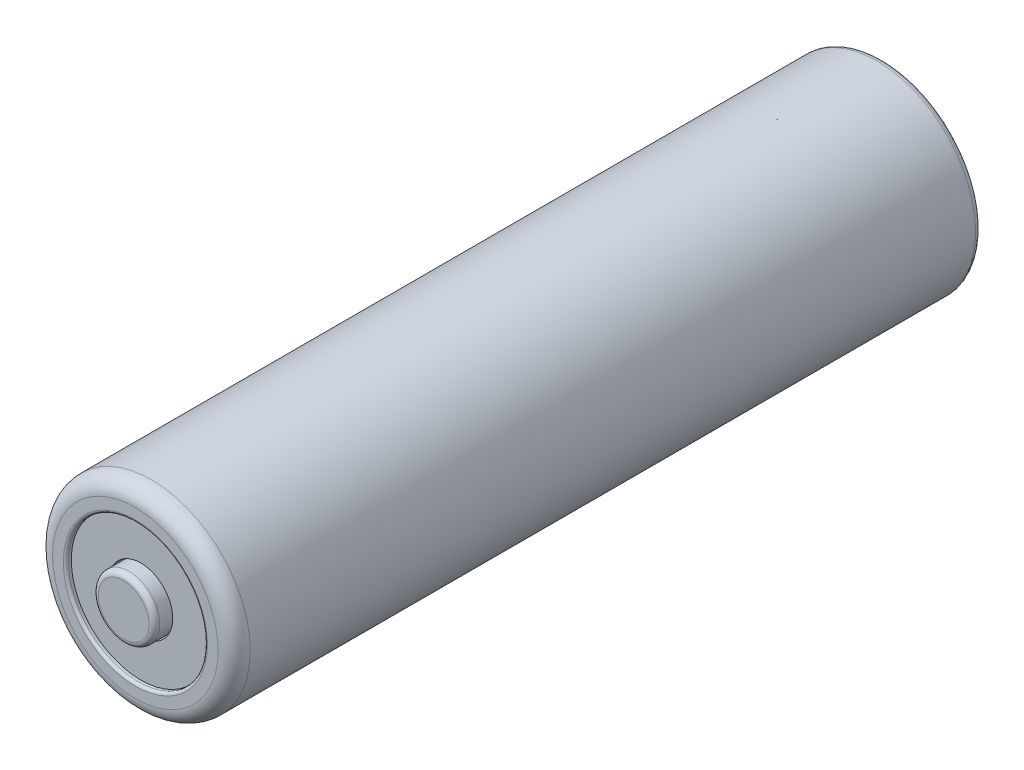
ISO-10303-21;
HEADER;
FILE_DESCRIPTION(('STEP AP214'),'2;1');
FILE_NAME('part.step','',(''),(''),'','','');
FILE_SCHEMA(('AUTOMOTIVE_DESIGN { 1 0 10303 214 1 1 1 1 }'));
ENDSEC;
DATA;
#1=APPLICATION_CONTEXT('core data for automotive mechanical design processes');
#2=APPLICATION_PROTOCOL_DEFINITION('international standard','automotive_design',2000,#1);
#3=PRODUCT_CONTEXT('',#1,'mechanical');
#4=PRODUCT('Part','Part','',(#3));
#5=PRODUCT_RELATED_PRODUCT_CATEGORY('part','',(#4));
#6=PRODUCT_DEFINITION_FORMATION('','',#4);
#7=PRODUCT_DEFINITION_CONTEXT('part definition',#1,'design');
#8=PRODUCT_DEFINITION('design','',#6,#7);
#9=PRODUCT_DEFINITION_SHAPE('','',#8);
#10=(LENGTH_UNIT() NAMED_UNIT(*) SI_UNIT(.MILLI.,.METRE.));
#11=(NAMED_UNIT(*) PLANE_ANGLE_UNIT() SI_UNIT($,.RADIAN.));
#12=(NAMED_UNIT(*) SI_UNIT($,.STERADIAN.) SOLID_ANGLE_UNIT());
#13=UNCERTAINTY_MEASURE_WITH_UNIT(LENGTH_MEASURE(1.E-05),#10,'distance_accuracy_value','');
#14=(GEOMETRIC_REPRESENTATION_CONTEXT(3) GLOBAL_UNCERTAINTY_ASSIGNED_CONTEXT((#13)) GLOBAL_UNIT_ASSIGNED_CONTEXT((#10,
#11,#12)) REPRESENTATION_CONTEXT('',''));
#15=CARTESIAN_POINT('',(0.,0.,0.));
#16=DIRECTION('',(0.,0.,1.));
#17=DIRECTION('',(1.,0.,0.));
#18=AXIS2_PLACEMENT_3D('',#15,#16,#17);
#19=CARTESIAN_POINT('',(0.,0.,0.250000000000004));
#20=DIRECTION('',(0.,0.,1.));
#21=DIRECTION('',(1.,0.,0.));
#22=AXIS2_PLACEMENT_3D('',#19,#20,#21);
#23=TOROIDAL_SURFACE('',#22,6.75,0.25);
#24=CARTESIAN_POINT('',(0.,0.,0.));
#25=DIRECTION('',(0.,0.,-1.));
#26=DIRECTION('',(-1.,0.,0.));
#27=AXIS2_PLACEMENT_3D('',#24,#25,#26);
#28=CIRCLE('',#27,6.75);
#29=CARTESIAN_POINT('',(-6.75,0.,0.));
#30=VERTEX_POINT('',#29);
#31=EDGE_CURVE('P0_E26',#30,#30,#28,.T.);
#32=ORIENTED_EDGE('',*,*,#31,.T.);
#33=CARTESIAN_POINT('',(-6.75,0.,0.250000000000004));
#34=DIRECTION('',(0.,-1.,0.));
#35=DIRECTION('',(-1.,0.,0.));
#36=AXIS2_PLACEMENT_3D('',#33,#34,#35);
#37=CIRCLE('',#36,0.25);
#38=CARTESIAN_POINT('',(-6.5,0.,0.250000000000004));
#39=VERTEX_POINT('',#38);
#40=EDGE_CURVE('P0_E11',#30,#39,#37,.T.);
#41=ORIENTED_EDGE('',*,*,#40,.T.);
#42=CARTESIAN_POINT('',(0.,0.,0.250000000000004));
#43=DIRECTION('',(0.,0.,1.));
#44=DIRECTION('',(-1.,0.,0.));
#45=AXIS2_PLACEMENT_3D('',#42,#43,#44);
#46=CIRCLE('',#45,6.5);
#47=CARTESIAN_POINT('',(6.5,0.,0.250000000000004));
#48=VERTEX_POINT('',#47);
#49=EDGE_CURVE('P0_E94',#39,#48,#46,.T.);
#50=ORIENTED_EDGE('',*,*,#49,.T.);
#51=CARTESIAN_POINT('',(0.,0.,0.250000000000004));
#52=DIRECTION('',(0.,0.,1.));
#53=DIRECTION('',(-1.,0.,0.));
#54=AXIS2_PLACEMENT_3D('',#51,#52,#53);
#55=CIRCLE('',#54,6.5);
#56=EDGE_CURVE('P0_E91',#48,#39,#55,.T.);
#57=ORIENTED_EDGE('',*,*,#56,.T.);
#58=ORIENTED_EDGE('',*,*,#40,.F.);
#59=EDGE_LOOP('',(#32,#41,#50,#57,#58));
#60=FACE_BOUND('',#59,.T.);
#61=ADVANCED_FACE('P0_F17',(#60),#23,.T.);
#62=CARTESIAN_POINT('',(0.,0.,0.));
#63=DIRECTION('',(0.,0.,1.));
#64=DIRECTION('',(1.,0.,0.));
#65=AXIS2_PLACEMENT_3D('',#62,#63,#64);
#66=PLANE('',#65);
#67=ORIENTED_EDGE('',*,*,#31,.F.);
#68=EDGE_LOOP('',(#67));
#69=FACE_BOUND('',#68,.T.);
#70=CARTESIAN_POINT('',(0.,0.,0.));
#71=DIRECTION('',(0.,0.,1.));
#72=DIRECTION('',(1.,0.,0.));
#73=AXIS2_PLACEMENT_3D('',#70,#71,#72);
#74=CIRCLE('',#73,8.65);
#75=CARTESIAN_POINT('',(-8.65,0.,0.));
#76=VERTEX_POINT('',#75);
#77=EDGE_CURVE('P0_E20',#76,#76,#74,.T.);
#78=ORIENTED_EDGE('',*,*,#77,.F.);
#79=EDGE_LOOP('',(#78));
#80=FACE_BOUND('',#79,.T.);
#81=ADVANCED_FACE('P0_F124',(#69,#80),#66,.F.);
#82=CARTESIAN_POINT('',(0.,0.,0.6));
#83=DIRECTION('',(0.,0.,1.));
#84=DIRECTION('',(1.,0.,0.));
#85=AXIS2_PLACEMENT_3D('',#82,#83,#84);
#86=TOROIDAL_SURFACE('',#85,8.65,0.6);
#87=CARTESIAN_POINT('',(0.,0.,0.6));
#88=DIRECTION('',(0.,0.,-1.));
#89=DIRECTION('',(1.,0.,0.));
#90=AXIS2_PLACEMENT_3D('',#87,#88,#89);
#91=CIRCLE('',#90,9.25);
#92=CARTESIAN_POINT('',(-9.25,0.,0.6));
#93=VERTEX_POINT('',#92);
#94=EDGE_CURVE('P0_E107',#93,#93,#91,.T.);
#95=ORIENTED_EDGE('',*,*,#94,.T.);
#96=CARTESIAN_POINT('',(-8.65,0.,0.6));
#97=DIRECTION('',(0.,-1.,0.));
#98=DIRECTION('',(-1.,0.,0.));
#99=AXIS2_PLACEMENT_3D('',#96,#97,#98);
#100=CIRCLE('',#99,0.6);
#101=EDGE_CURVE('P0_E110',#93,#76,#100,.T.);
#102=ORIENTED_EDGE('',*,*,#101,.T.);
#103=ORIENTED_EDGE('',*,*,#77,.T.);
#104=ORIENTED_EDGE('',*,*,#101,.F.);
#105=EDGE_LOOP('',(#95,#102,#103,#104));
#106=FACE_BOUND('',#105,.T.);
#107=ADVANCED_FACE('P0_F127',(#106),#86,.T.);
#108=CARTESIAN_POINT('',(0.,0.,0.));
#109=DIRECTION('',(0.,0.,1.));
#110=DIRECTION('',(1.,0.,0.));
#111=AXIS2_PLACEMENT_3D('',#108,#109,#110);
#112=CYLINDRICAL_SURFACE('',#111,9.25);
#113=CARTESIAN_POINT('',(0.,0.,68.5));
#114=DIRECTION('',(0.,0.,1.));
#115=DIRECTION('',(1.,0.,0.));
#116=AXIS2_PLACEMENT_3D('',#113,#114,#115);
#117=CIRCLE('',#116,9.25);
#118=CARTESIAN_POINT('',(-9.25,0.,68.5));
#119=VERTEX_POINT('',#118);
#120=EDGE_CURVE('P0_E102',#119,#119,#117,.T.);
#121=ORIENTED_EDGE('',*,*,#120,.F.);
#122=DIRECTION('',(0.,0.,-1.));
#123=VECTOR('',#122,1.);
#124=CARTESIAN_POINT('',(-9.25,0.,0.));
#125=LINE('',#124,#123);
#126=EDGE_CURVE('P0_E103',#119,#93,#125,.T.);
#127=ORIENTED_EDGE('',*,*,#126,.T.);
#128=ORIENTED_EDGE('',*,*,#94,.F.);
#129=ORIENTED_EDGE('',*,*,#126,.F.);
#130=EDGE_LOOP('',(#121,#127,#128,#129));
#131=FACE_BOUND('',#130,.T.);
#132=ADVANCED_FACE('P0_F133',(#131),#112,.T.);
#133=CARTESIAN_POINT('',(0.,0.,68.5));
#134=DIRECTION('',(0.,0.,1.));
#135=DIRECTION('',(1.,0.,0.));
#136=AXIS2_PLACEMENT_3D('',#133,#134,#135);
#137=TOROIDAL_SURFACE('',#136,7.75,1.5);
#138=CARTESIAN_POINT('',(0.,0.,70.));
#139=DIRECTION('',(0.,0.,-1.));
#140=DIRECTION('',(1.,0.,0.));
#141=AXIS2_PLACEMENT_3D('',#138,#139,#140);
#142=CIRCLE('',#141,7.75);
#143=CARTESIAN_POINT('',(-7.75,0.,70.));
#144=VERTEX_POINT('',#143);
#145=EDGE_CURVE('P0_E86',#144,#144,#142,.T.);
#146=ORIENTED_EDGE('',*,*,#145,.T.);
#147=CARTESIAN_POINT('',(-7.75,0.,68.5));
#148=DIRECTION('',(0.,-1.,0.));
#149=DIRECTION('',(-1.,0.,0.));
#150=AXIS2_PLACEMENT_3D('',#147,#148,#149);
#151=CIRCLE('',#150,1.5);
#152=EDGE_CURVE('P0_E93',#144,#119,#151,.T.);
#153=ORIENTED_EDGE('',*,*,#152,.T.);
#154=ORIENTED_EDGE('',*,*,#120,.T.);
#155=ORIENTED_EDGE('',*,*,#152,.F.);
#156=EDGE_LOOP('',(#146,#153,#154,#155));
#157=FACE_BOUND('',#156,.T.);
#158=ADVANCED_FACE('P0_F139',(#157),#137,.T.);
#159=CARTESIAN_POINT('',(0.,0.,70.));
#160=DIRECTION('',(0.,0.,-1.));
#161=DIRECTION('',(-1.,0.,0.));
#162=AXIS2_PLACEMENT_3D('',#159,#160,#161);
#163=CYLINDRICAL_SURFACE('',#162,6.5);
#164=CARTESIAN_POINT('',(0.,0.,69.75));
#165=DIRECTION('',(0.,0.,-1.));
#166=DIRECTION('',(-1.,0.,0.));
#167=AXIS2_PLACEMENT_3D('',#164,#165,#166);
#168=CIRCLE('',#167,6.5);
#169=CARTESIAN_POINT('',(6.5,0.,69.75));
#170=VERTEX_POINT('',#169);
#171=EDGE_CURVE('P0_E80',#170,#170,#168,.T.);
#172=ORIENTED_EDGE('',*,*,#171,.F.);
#173=DIRECTION('',(0.,0.,-1.));
#174=VECTOR('',#173,1.);
#175=CARTESIAN_POINT('',(6.5,0.,70.));
#176=LINE('',#175,#174);
#177=EDGE_CURVE('P0_E95',#170,#48,#176,.T.);
#178=ORIENTED_EDGE('',*,*,#177,.T.);
#179=ORIENTED_EDGE('',*,*,#49,.F.);
#180=ORIENTED_EDGE('',*,*,#56,.F.);
#181=ORIENTED_EDGE('',*,*,#177,.F.);
#182=EDGE_LOOP('',(#172,#178,#179,#180,#181));
#183=FACE_BOUND('',#182,.T.);
#184=ADVANCED_FACE('P0_F136',(#183),#163,.F.);
#185=CARTESIAN_POINT('',(0.,0.,70.));
#186=DIRECTION('',(0.,0.,1.));
#187=DIRECTION('',(1.,0.,0.));
#188=AXIS2_PLACEMENT_3D('',#185,#186,#187);
#189=PLANE('',#188);
#190=CARTESIAN_POINT('',(0.,0.,70.));
#191=DIRECTION('',(0.,0.,1.));
#192=DIRECTION('',(-1.,0.,0.));
#193=AXIS2_PLACEMENT_3D('',#190,#191,#192);
#194=CIRCLE('',#193,6.75);
#195=CARTESIAN_POINT('',(6.75,0.,70.));
#196=VERTEX_POINT('',#195);
#197=EDGE_CURVE('P0_E78',#196,#196,#194,.T.);
#198=ORIENTED_EDGE('',*,*,#197,.F.);
#199=EDGE_LOOP('',(#198));
#200=FACE_BOUND('',#199,.T.);
#201=ORIENTED_EDGE('',*,*,#145,.F.);
#202=EDGE_LOOP('',(#201));
#203=FACE_BOUND('',#202,.T.);
#204=ADVANCED_FACE('P0_F138',(#200,#203),#189,.T.);
#205=CARTESIAN_POINT('',(0.,0.,69.75));
#206=DIRECTION('',(0.,0.,-1.));
#207=DIRECTION('',(-1.,0.,0.));
#208=AXIS2_PLACEMENT_3D('',#205,#206,#207);
#209=TOROIDAL_SURFACE('',#208,6.75,0.25);
#210=ORIENTED_EDGE('',*,*,#197,.T.);
#211=CARTESIAN_POINT('',(6.75,0.,69.75));
#212=DIRECTION('',(0.,-1.,0.));
#213=DIRECTION('',(1.,0.,0.));
#214=AXIS2_PLACEMENT_3D('',#211,#212,#213);
#215=CIRCLE('',#214,0.25);
#216=EDGE_CURVE('P0_E75',#196,#170,#215,.T.);
#217=ORIENTED_EDGE('',*,*,#216,.T.);
#218=ORIENTED_EDGE('',*,*,#171,.T.);
#219=ORIENTED_EDGE('',*,*,#216,.F.);
#220=EDGE_LOOP('',(#210,#217,#218,#219));
#221=FACE_BOUND('',#220,.T.);
#222=ADVANCED_FACE('P0_F76',(#221),#209,.T.);
#223=CLOSED_SHELL('',(#61,#81,#107,#132,#158,#184,#204,#222));
#224=MANIFOLD_SOLID_BREP('P0_B1',#223);
#225=CARTESIAN_POINT('',(0.,0.,70.));
#226=DIRECTION('',(0.,0.,-1.));
#227=DIRECTION('',(-1.,0.,0.));
#228=AXIS2_PLACEMENT_3D('',#225,#226,#227);
#229=CYLINDRICAL_SURFACE('',#228,6.5);
#230=CARTESIAN_POINT('',(0.,0.,65.));
#231=DIRECTION('',(0.,0.,1.));
#232=DIRECTION('',(-1.,0.,0.));
#233=AXIS2_PLACEMENT_3D('',#230,#231,#232);
#234=CIRCLE('',#233,6.5);
#235=CARTESIAN_POINT('',(6.5,0.,65.));
#236=VERTEX_POINT('',#235);
#237=EDGE_CURVE('P1_E27',#236,#236,#234,.T.);
#238=ORIENTED_EDGE('',*,*,#237,.T.);
#239=DIRECTION('',(0.,0.,1.));
#240=VECTOR('',#239,1.);
#241=CARTESIAN_POINT('',(6.5,0.,70.));
#242=LINE('',#241,#240);
#243=CARTESIAN_POINT('',(6.5,0.,69.5));
#244=VERTEX_POINT('',#243);
#245=EDGE_CURVE('P1_E11',#236,#244,#242,.T.);
#246=ORIENTED_EDGE('',*,*,#245,.T.);
#247=CARTESIAN_POINT('',(0.,0.,69.5));
#248=DIRECTION('',(0.,0.,-1.));
#249=DIRECTION('',(-1.,0.,0.));
#250=AXIS2_PLACEMENT_3D('',#247,#248,#249);
#251=CIRCLE('',#250,6.5);
#252=EDGE_CURVE('P1_E59',#244,#244,#251,.T.);
#253=ORIENTED_EDGE('',*,*,#252,.T.);
#254=ORIENTED_EDGE('',*,*,#245,.F.);
#255=EDGE_LOOP('',(#238,#246,#253,#254));
#256=FACE_BOUND('',#255,.T.);
#257=ADVANCED_FACE('P1_F17',(#256),#229,.T.);
#258=CARTESIAN_POINT('',(0.,0.,65.));
#259=DIRECTION('',(0.,0.,1.));
#260=DIRECTION('',(1.,0.,0.));
#261=AXIS2_PLACEMENT_3D('',#258,#259,#260);
#262=PLANE('',#261);
#263=CARTESIAN_POINT('',(0.,0.,65.));
#264=DIRECTION('',(0.,0.,1.));
#265=DIRECTION('',(-1.,0.,0.));
#266=AXIS2_PLACEMENT_3D('',#263,#264,#265);
#267=CIRCLE('',#266,3.);
#268=CARTESIAN_POINT('',(3.,0.,65.));
#269=VERTEX_POINT('',#268);
#270=EDGE_CURVE('P1_E55',#269,#269,#267,.T.);
#271=ORIENTED_EDGE('',*,*,#270,.T.);
#272=EDGE_LOOP('',(#271));
#273=FACE_BOUND('',#272,.T.);
#274=ORIENTED_EDGE('',*,*,#237,.F.);
#275=EDGE_LOOP('',(#274));
#276=FACE_BOUND('',#275,.T.);
#277=ADVANCED_FACE('P1_F56',(#273,#276),#262,.F.);
#278=CARTESIAN_POINT('',(0.,0.,69.5));
#279=DIRECTION('',(0.,0.,1.));
#280=DIRECTION('',(1.,0.,0.));
#281=AXIS2_PLACEMENT_3D('',#278,#279,#280);
#282=PLANE('',#281);
#283=CARTESIAN_POINT('',(0.,0.,69.5));
#284=DIRECTION('',(0.,0.,-1.));
#285=DIRECTION('',(-1.,0.,0.));
#286=AXIS2_PLACEMENT_3D('',#283,#284,#285);
#287=CIRCLE('',#286,3.);
#288=CARTESIAN_POINT('',(3.,0.,69.5));
#289=VERTEX_POINT('',#288);
#290=EDGE_CURVE('P1_E66',#289,#289,#287,.T.);
#291=ORIENTED_EDGE('',*,*,#290,.T.);
#292=EDGE_LOOP('',(#291));
#293=FACE_BOUND('',#292,.T.);
#294=ORIENTED_EDGE('',*,*,#252,.F.);
#295=EDGE_LOOP('',(#294));
#296=FACE_BOUND('',#295,.T.);
#297=ADVANCED_FACE('P1_F71',(#293,#296),#282,.T.);
#298=CARTESIAN_POINT('',(0.,0.,69.5));
#299=DIRECTION('',(0.,0.,-1.));
#300=DIRECTION('',(-1.,0.,0.));
#301=AXIS2_PLACEMENT_3D('',#298,#299,#300);
#302=CYLINDRICAL_SURFACE('',#301,3.);
#303=ORIENTED_EDGE('',*,*,#290,.F.);
#304=DIRECTION('',(0.,0.,-1.));
#305=VECTOR('',#304,1.);
#306=CARTESIAN_POINT('',(3.,0.,69.5));
#307=LINE('',#306,#305);
#308=EDGE_CURVE('P1_E20',#289,#269,#307,.T.);
#309=ORIENTED_EDGE('',*,*,#308,.T.);
#310=ORIENTED_EDGE('',*,*,#270,.F.);
#311=ORIENTED_EDGE('',*,*,#308,.F.);
#312=EDGE_LOOP('',(#303,#309,#310,#311));
#313=FACE_BOUND('',#312,.T.);
#314=ADVANCED_FACE('P1_F73',(#313),#302,.F.);
#315=CLOSED_SHELL('',(#257,#277,#297,#314));
#316=MANIFOLD_SOLID_BREP('P1_B1',#315);
#317=CARTESIAN_POINT('',(0.,0.,65.));
#318=DIRECTION('',(0.,0.,-1.));
#319=DIRECTION('',(0.,-1.,0.));
#320=AXIS2_PLACEMENT_3D('',#317,#318,#319);
#321=PLANE('',#320);
#322=CARTESIAN_POINT('',(0.,0.,65.));
#323=DIRECTION('',(0.,0.,1.));
#324=DIRECTION('',(1.,0.,0.));
#325=AXIS2_PLACEMENT_3D('',#322,#323,#324);
#326=CIRCLE('',#325,6.5);
#327=CARTESIAN_POINT('',(-6.5,0.,65.));
#328=VERTEX_POINT('',#327);
#329=EDGE_CURVE('P2_E27',#328,#328,#326,.T.);
#330=ORIENTED_EDGE('',*,*,#329,.T.);
#331=EDGE_LOOP('',(#330));
#332=FACE_BOUND('',#331,.T.);
#333=ADVANCED_FACE('P2_F17',(#332),#321,.F.);
#334=CARTESIAN_POINT('',(0.,0.,0.));
#335=DIRECTION('',(0.,0.,1.));
#336=DIRECTION('',(1.,0.,0.));
#337=AXIS2_PLACEMENT_3D('',#334,#335,#336);
#338=CYLINDRICAL_SURFACE('',#337,6.5);
#339=ORIENTED_EDGE('',*,*,#329,.F.);
#340=DIRECTION('',(0.,0.,-1.));
#341=VECTOR('',#340,1.);
#342=CARTESIAN_POINT('',(-6.5,0.,0.));
#343=LINE('',#342,#341);
#344=CARTESIAN_POINT('',(-6.5,0.,0.5));
#345=VERTEX_POINT('',#344);
#346=EDGE_CURVE('P2_E11',#328,#345,#343,.T.);
#347=ORIENTED_EDGE('',*,*,#346,.T.);
#348=CARTESIAN_POINT('',(0.,0.,0.5));
#349=DIRECTION('',(0.,0.,1.));
#350=DIRECTION('',(1.,0.,0.));
#351=AXIS2_PLACEMENT_3D('',#348,#349,#350);
#352=CIRCLE('',#351,6.5);
#353=EDGE_CURVE('P2_E21',#345,#345,#352,.T.);
#354=ORIENTED_EDGE('',*,*,#353,.T.);
#355=ORIENTED_EDGE('',*,*,#346,.F.);
#356=EDGE_LOOP('',(#339,#347,#354,#355));
#357=FACE_BOUND('',#356,.T.);
#358=ADVANCED_FACE('P2_F42',(#357),#338,.T.);
#359=CARTESIAN_POINT('',(0.,0.,0.5));
#360=DIRECTION('',(0.,0.,-1.));
#361=DIRECTION('',(0.,-1.,0.));
#362=AXIS2_PLACEMENT_3D('',#359,#360,#361);
#363=PLANE('',#362);
#364=ORIENTED_EDGE('',*,*,#353,.F.);
#365=EDGE_LOOP('',(#364));
#366=FACE_BOUND('',#365,.T.);
#367=ADVANCED_FACE('P2_F19',(#366),#363,.T.);
#368=CLOSED_SHELL('',(#333,#358,#367));
#369=MANIFOLD_SOLID_BREP('P2_B1',#368);
#370=CARTESIAN_POINT('',(0.,0.,65.));
#371=DIRECTION('',(0.,0.,1.));
#372=DIRECTION('',(1.,0.,0.));
#373=AXIS2_PLACEMENT_3D('',#370,#371,#372);
#374=PLANE('',#373);
#375=CARTESIAN_POINT('',(0.,0.,65.));
#376=DIRECTION('',(0.,0.,-1.));
#377=DIRECTION('',(-1.,0.,0.));
#378=AXIS2_PLACEMENT_3D('',#375,#376,#377);
#379=CIRCLE('',#378,2.875);
#380=CARTESIAN_POINT('',(2.875,0.,65.));
#381=VERTEX_POINT('',#380);
#382=EDGE_CURVE('P3_E10',#381,#381,#379,.T.);
#383=ORIENTED_EDGE('',*,*,#382,.T.);
#384=EDGE_LOOP('',(#383));
#385=FACE_BOUND('',#384,.T.);
#386=ADVANCED_FACE('P3_F16',(#385),#374,.F.);
#387=CARTESIAN_POINT('',(0.,0.,71.1));
#388=DIRECTION('',(0.,0.,1.));
#389=DIRECTION('',(1.,0.,0.));
#390=AXIS2_PLACEMENT_3D('',#387,#388,#389);
#391=PLANE('',#390);
#392=CARTESIAN_POINT('',(0.,0.,71.1));
#393=DIRECTION('',(0.,0.,-1.));
#394=DIRECTION('',(-1.,0.,0.));
#395=AXIS2_PLACEMENT_3D('',#392,#393,#394);
#396=CIRCLE('',#395,2.375);
#397=CARTESIAN_POINT('',(-2.375,0.,71.1));
#398=VERTEX_POINT('',#397);
#399=EDGE_CURVE('P3_E62',#398,#398,#396,.T.);
#400=ORIENTED_EDGE('',*,*,#399,.F.);
#401=EDGE_LOOP('',(#400));
#402=FACE_BOUND('',#401,.T.);
#403=ADVANCED_FACE('P3_F88',(#402),#391,.T.);
#404=CARTESIAN_POINT('',(0.,0.,69.5));
#405=DIRECTION('',(0.,0.,1.));
#406=DIRECTION('',(-1.,0.,0.));
#407=AXIS2_PLACEMENT_3D('',#404,#405,#406);
#408=CYLINDRICAL_SURFACE('',#407,2.875);
#409=CARTESIAN_POINT('',(0.,0.,70.6));
#410=DIRECTION('',(0.,0.,1.));
#411=DIRECTION('',(-1.,0.,0.));
#412=AXIS2_PLACEMENT_3D('',#409,#410,#411);
#413=CIRCLE('',#412,2.875);
#414=CARTESIAN_POINT('',(2.875,0.,70.6));
#415=VERTEX_POINT('',#414);
#416=CARTESIAN_POINT('',(-2.875,0.,70.6));
#417=VERTEX_POINT('',#416);
#418=EDGE_CURVE('P3_E52',#415,#417,#413,.T.);
#419=ORIENTED_EDGE('',*,*,#418,.F.);
#420=DIRECTION('',(0.,0.,-1.));
#421=VECTOR('',#420,1.);
#422=CARTESIAN_POINT('',(2.875,0.,69.5));
#423=LINE('',#422,#421);
#424=EDGE_CURVE('P3_E26',#415,#381,#423,.T.);
#425=ORIENTED_EDGE('',*,*,#424,.T.);
#426=ORIENTED_EDGE('',*,*,#382,.F.);
#427=ORIENTED_EDGE('',*,*,#424,.F.);
#428=CARTESIAN_POINT('',(0.,0.,70.6));
#429=DIRECTION('',(0.,0.,1.));
#430=DIRECTION('',(-1.,0.,0.));
#431=AXIS2_PLACEMENT_3D('',#428,#429,#430);
#432=CIRCLE('',#431,2.875);
#433=EDGE_CURVE('P3_E55',#417,#415,#432,.T.);
#434=ORIENTED_EDGE('',*,*,#433,.F.);
#435=EDGE_LOOP('',(#419,#425,#426,#427,#434));
#436=FACE_BOUND('',#435,.T.);
#437=ADVANCED_FACE('P3_F18',(#436),#408,.T.);
#438=CARTESIAN_POINT('',(0.,0.,70.6));
#439=DIRECTION('',(0.,0.,1.));
#440=DIRECTION('',(1.,0.,0.));
#441=AXIS2_PLACEMENT_3D('',#438,#439,#440);
#442=TOROIDAL_SURFACE('',#441,2.375,0.5);
#443=ORIENTED_EDGE('',*,*,#399,.T.);
#444=CARTESIAN_POINT('',(-2.375,0.,70.6));
#445=DIRECTION('',(0.,-1.,0.));
#446=DIRECTION('',(-1.,0.,0.));
#447=AXIS2_PLACEMENT_3D('',#444,#445,#446);
#448=CIRCLE('',#447,0.5);
#449=EDGE_CURVE('P3_E47',#398,#417,#448,.T.);
#450=ORIENTED_EDGE('',*,*,#449,.T.);
#451=ORIENTED_EDGE('',*,*,#433,.T.);
#452=ORIENTED_EDGE('',*,*,#418,.T.);
#453=ORIENTED_EDGE('',*,*,#449,.F.);
#454=EDGE_LOOP('',(#443,#450,#451,#452,#453));
#455=FACE_BOUND('',#454,.T.);
#456=ADVANCED_FACE('P3_F54',(#455),#442,.T.);
#457=CLOSED_SHELL('',(#386,#403,#437,#456));
#458=MANIFOLD_SOLID_BREP('P3_B1',#457);
#459=ADVANCED_BREP_SHAPE_REPRESENTATION('',(#18,#224,#316,#369,#458),#14);
#460=SHAPE_DEFINITION_REPRESENTATION(#9,#459);
ENDSEC;
END-ISO-10303-21;
